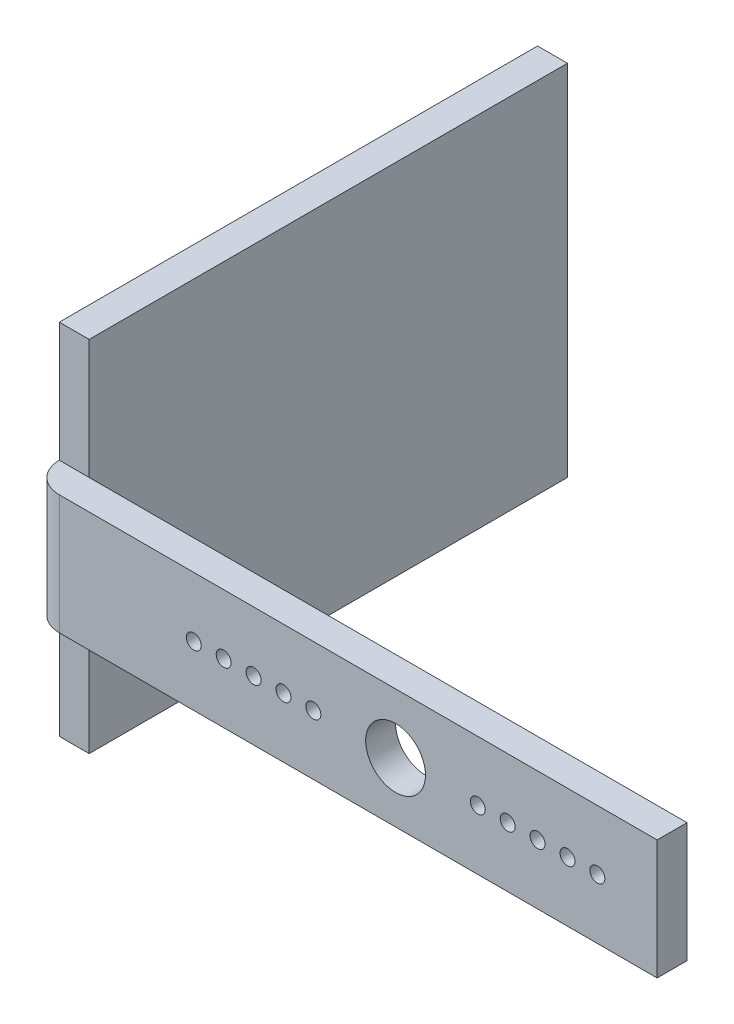
ISO-10303-21;
HEADER;
FILE_DESCRIPTION(('STEP AP214'),'2;1');
FILE_NAME('part.step','',(''),(''),'','','');
FILE_SCHEMA(('AUTOMOTIVE_DESIGN { 1 0 10303 214 1 1 1 1 }'));
ENDSEC;
DATA;
#1=APPLICATION_CONTEXT('core data for automotive mechanical design processes');
#2=APPLICATION_PROTOCOL_DEFINITION('international standard','automotive_design',2000,#1);
#3=PRODUCT_CONTEXT('',#1,'mechanical');
#4=PRODUCT('Part','Part','',(#3));
#5=PRODUCT_RELATED_PRODUCT_CATEGORY('part','',(#4));
#6=PRODUCT_DEFINITION_FORMATION('','',#4);
#7=PRODUCT_DEFINITION_CONTEXT('part definition',#1,'design');
#8=PRODUCT_DEFINITION('design','',#6,#7);
#9=PRODUCT_DEFINITION_SHAPE('','',#8);
#10=(LENGTH_UNIT() NAMED_UNIT(*) SI_UNIT(.MILLI.,.METRE.));
#11=(NAMED_UNIT(*) PLANE_ANGLE_UNIT() SI_UNIT($,.RADIAN.));
#12=(NAMED_UNIT(*) SI_UNIT($,.STERADIAN.) SOLID_ANGLE_UNIT());
#13=UNCERTAINTY_MEASURE_WITH_UNIT(LENGTH_MEASURE(1.E-05),#10,'distance_accuracy_value','');
#14=(GEOMETRIC_REPRESENTATION_CONTEXT(3) GLOBAL_UNCERTAINTY_ASSIGNED_CONTEXT((#13)) GLOBAL_UNIT_ASSIGNED_CONTEXT((#10,
#11,#12)) REPRESENTATION_CONTEXT('',''));
#15=CARTESIAN_POINT('',(0.,0.,0.));
#16=DIRECTION('',(0.,0.,1.));
#17=DIRECTION('',(1.,0.,0.));
#18=AXIS2_PLACEMENT_3D('',#15,#16,#17);
#19=CARTESIAN_POINT('',(-34.925,19.05,0.));
#20=DIRECTION('',(0.,0.,-1.));
#21=DIRECTION('',(0.,1.,0.));
#22=AXIS2_PLACEMENT_3D('',#19,#20,#21);
#23=PLANE('',#22);
#24=DIRECTION('',(-1.,0.,0.));
#25=VECTOR('',#24,1.);
#26=CARTESIAN_POINT('',(-34.925,6.35,0.));
#27=LINE('',#26,#25);
#28=CARTESIAN_POINT('',(-31.75,6.35,0.));
#29=VERTEX_POINT('',#28);
#30=CARTESIAN_POINT('',(-34.925,6.35,0.));
#31=VERTEX_POINT('',#30);
#32=EDGE_CURVE('E143',#29,#31,#27,.T.);
#33=ORIENTED_EDGE('',*,*,#32,.F.);
#34=DIRECTION('',(0.,1.,0.));
#35=VECTOR('',#34,1.);
#36=CARTESIAN_POINT('',(-31.75,19.05,0.));
#37=LINE('',#36,#35);
#38=CARTESIAN_POINT('',(-31.75,19.05,0.));
#39=VERTEX_POINT('',#38);
#40=EDGE_CURVE('E324',#29,#39,#37,.T.);
#41=ORIENTED_EDGE('',*,*,#40,.T.);
#42=DIRECTION('',(1.,0.,0.));
#43=VECTOR('',#42,1.);
#44=CARTESIAN_POINT('',(-34.925,19.05,0.));
#45=LINE('',#44,#43);
#46=CARTESIAN_POINT('',(-34.925,19.05,0.));
#47=VERTEX_POINT('',#46);
#48=EDGE_CURVE('E340',#47,#39,#45,.T.);
#49=ORIENTED_EDGE('',*,*,#48,.F.);
#50=DIRECTION('',(0.,1.,0.));
#51=VECTOR('',#50,1.);
#52=CARTESIAN_POINT('',(-34.925,19.05,0.));
#53=LINE('',#52,#51);
#54=EDGE_CURVE('E158',#31,#47,#53,.T.);
#55=ORIENTED_EDGE('',*,*,#54,.F.);
#56=EDGE_LOOP('',(#33,#41,#49,#55));
#57=FACE_BOUND('',#56,.T.);
#58=ADVANCED_FACE('F33',(#57),#23,.F.);
#59=CARTESIAN_POINT('',(-34.925,19.05,-50.8));
#60=DIRECTION('',(0.,0.,1.));
#61=DIRECTION('',(0.,-1.,0.));
#62=AXIS2_PLACEMENT_3D('',#59,#60,#61);
#63=PLANE('',#62);
#64=DIRECTION('',(0.,-1.,0.));
#65=VECTOR('',#64,1.);
#66=CARTESIAN_POINT('',(-31.75,19.05,-50.8));
#67=LINE('',#66,#65);
#68=CARTESIAN_POINT('',(-31.75,19.05,-50.8));
#69=VERTEX_POINT('',#68);
#70=CARTESIAN_POINT('',(-31.75,-19.05,-50.8));
#71=VERTEX_POINT('',#70);
#72=EDGE_CURVE('E167',#69,#71,#67,.T.);
#73=ORIENTED_EDGE('',*,*,#72,.T.);
#74=DIRECTION('',(1.,0.,0.));
#75=VECTOR('',#74,1.);
#76=CARTESIAN_POINT('',(-34.925,-19.05,-50.8));
#77=LINE('',#76,#75);
#78=CARTESIAN_POINT('',(-34.925,-19.05,-50.8));
#79=VERTEX_POINT('',#78);
#80=EDGE_CURVE('E276',#79,#71,#77,.T.);
#81=ORIENTED_EDGE('',*,*,#80,.F.);
#82=DIRECTION('',(0.,-1.,0.));
#83=VECTOR('',#82,1.);
#84=CARTESIAN_POINT('',(-34.925,19.05,-50.8));
#85=LINE('',#84,#83);
#86=CARTESIAN_POINT('',(-34.925,19.05,-50.8));
#87=VERTEX_POINT('',#86);
#88=EDGE_CURVE('E326',#87,#79,#85,.T.);
#89=ORIENTED_EDGE('',*,*,#88,.F.);
#90=DIRECTION('',(1.,0.,0.));
#91=VECTOR('',#90,1.);
#92=CARTESIAN_POINT('',(-34.925,19.05,-50.8));
#93=LINE('',#92,#91);
#94=EDGE_CURVE('E338',#87,#69,#93,.T.);
#95=ORIENTED_EDGE('',*,*,#94,.T.);
#96=EDGE_LOOP('',(#73,#81,#89,#95));
#97=FACE_BOUND('',#96,.T.);
#98=ADVANCED_FACE('F295',(#97),#63,.F.);
#99=CARTESIAN_POINT('',(-34.925,-19.05,-50.8));
#100=DIRECTION('',(0.,1.,0.));
#101=DIRECTION('',(0.,0.,1.));
#102=AXIS2_PLACEMENT_3D('',#99,#100,#101);
#103=PLANE('',#102);
#104=DIRECTION('',(0.,0.,1.));
#105=VECTOR('',#104,1.);
#106=CARTESIAN_POINT('',(-31.75,-19.05,-50.8));
#107=LINE('',#106,#105);
#108=CARTESIAN_POINT('',(-31.75,-19.05,0.));
#109=VERTEX_POINT('',#108);
#110=EDGE_CURVE('E328',#71,#109,#107,.T.);
#111=ORIENTED_EDGE('',*,*,#110,.T.);
#112=DIRECTION('',(1.,0.,0.));
#113=VECTOR('',#112,1.);
#114=CARTESIAN_POINT('',(-34.925,-19.05,0.));
#115=LINE('',#114,#113);
#116=CARTESIAN_POINT('',(-34.925,-19.05,0.));
#117=VERTEX_POINT('',#116);
#118=EDGE_CURVE('E322',#117,#109,#115,.T.);
#119=ORIENTED_EDGE('',*,*,#118,.F.);
#120=DIRECTION('',(0.,0.,1.));
#121=VECTOR('',#120,1.);
#122=CARTESIAN_POINT('',(-34.925,-19.05,-50.8));
#123=LINE('',#122,#121);
#124=EDGE_CURVE('E87',#79,#117,#123,.T.);
#125=ORIENTED_EDGE('',*,*,#124,.F.);
#126=ORIENTED_EDGE('',*,*,#80,.T.);
#127=EDGE_LOOP('',(#111,#119,#125,#126));
#128=FACE_BOUND('',#127,.T.);
#129=ADVANCED_FACE('F302',(#128),#103,.F.);
#130=CARTESIAN_POINT('',(-31.75,-6.35,0.));
#131=VERTEX_POINT('',#130);
#132=EDGE_CURVE('E319',#109,#131,#37,.T.);
#133=ORIENTED_EDGE('',*,*,#132,.T.);
#134=DIRECTION('',(-1.,0.,0.));
#135=VECTOR('',#134,1.);
#136=CARTESIAN_POINT('',(-34.925,-6.35,0.));
#137=LINE('',#136,#135);
#138=CARTESIAN_POINT('',(-34.925,-6.34999999999998,0.));
#139=VERTEX_POINT('',#138);
#140=EDGE_CURVE('E153',#131,#139,#137,.T.);
#141=ORIENTED_EDGE('',*,*,#140,.T.);
#142=EDGE_CURVE('E346',#117,#139,#53,.T.);
#143=ORIENTED_EDGE('',*,*,#142,.F.);
#144=ORIENTED_EDGE('',*,*,#118,.T.);
#145=EDGE_LOOP('',(#133,#141,#143,#144));
#146=FACE_BOUND('',#145,.T.);
#147=ADVANCED_FACE('F298',(#146),#23,.F.);
#148=CARTESIAN_POINT('',(-34.925,19.05,-50.8));
#149=DIRECTION('',(0.,-1.,0.));
#150=DIRECTION('',(0.,0.,-1.));
#151=AXIS2_PLACEMENT_3D('',#148,#149,#150);
#152=PLANE('',#151);
#153=DIRECTION('',(0.,0.,-1.));
#154=VECTOR('',#153,1.);
#155=CARTESIAN_POINT('',(-31.75,19.05,-50.8));
#156=LINE('',#155,#154);
#157=EDGE_CURVE('E79',#39,#69,#156,.T.);
#158=ORIENTED_EDGE('',*,*,#157,.T.);
#159=ORIENTED_EDGE('',*,*,#94,.F.);
#160=DIRECTION('',(0.,0.,-1.));
#161=VECTOR('',#160,1.);
#162=CARTESIAN_POINT('',(-34.925,19.05,-50.8));
#163=LINE('',#162,#161);
#164=EDGE_CURVE('E58',#47,#87,#163,.T.);
#165=ORIENTED_EDGE('',*,*,#164,.F.);
#166=ORIENTED_EDGE('',*,*,#48,.T.);
#167=EDGE_LOOP('',(#158,#159,#165,#166));
#168=FACE_BOUND('',#167,.T.);
#169=ADVANCED_FACE('F309',(#168),#152,.F.);
#170=CARTESIAN_POINT('',(-34.925,-19.05,-50.8));
#171=DIRECTION('',(-1.,0.,0.));
#172=DIRECTION('',(0.,0.,1.));
#173=AXIS2_PLACEMENT_3D('',#170,#171,#172);
#174=PLANE('',#173);
#175=ORIENTED_EDGE('',*,*,#88,.T.);
#176=ORIENTED_EDGE('',*,*,#124,.T.);
#177=ORIENTED_EDGE('',*,*,#142,.T.);
#178=DIRECTION('',(0.,1.,0.));
#179=VECTOR('',#178,1.);
#180=CARTESIAN_POINT('',(-34.925,-6.35,0.));
#181=LINE('',#180,#179);
#182=EDGE_CURVE('E164',#139,#31,#181,.T.);
#183=ORIENTED_EDGE('',*,*,#182,.T.);
#184=ORIENTED_EDGE('',*,*,#54,.T.);
#185=ORIENTED_EDGE('',*,*,#164,.T.);
#186=EDGE_LOOP('',(#175,#176,#177,#183,#184,#185));
#187=FACE_BOUND('',#186,.T.);
#188=ADVANCED_FACE('F315',(#187),#174,.T.);
#189=CARTESIAN_POINT('',(-31.75,-19.05,-50.8));
#190=DIRECTION('',(-1.,0.,0.));
#191=DIRECTION('',(0.,0.,1.));
#192=AXIS2_PLACEMENT_3D('',#189,#190,#191);
#193=PLANE('',#192);
#194=ORIENTED_EDGE('',*,*,#40,.F.);
#195=DIRECTION('',(0.,-1.,0.));
#196=VECTOR('',#195,1.);
#197=CARTESIAN_POINT('',(-31.75,-6.35,0.));
#198=LINE('',#197,#196);
#199=EDGE_CURVE('E174',#29,#131,#198,.T.);
#200=ORIENTED_EDGE('',*,*,#199,.T.);
#201=ORIENTED_EDGE('',*,*,#132,.F.);
#202=ORIENTED_EDGE('',*,*,#110,.F.);
#203=ORIENTED_EDGE('',*,*,#72,.F.);
#204=ORIENTED_EDGE('',*,*,#157,.F.);
#205=EDGE_LOOP('',(#194,#200,#201,#202,#203,#204));
#206=FACE_BOUND('',#205,.T.);
#207=ADVANCED_FACE('F358',(#206),#193,.F.);
#208=CARTESIAN_POINT('',(-31.75,-6.35,0.));
#209=DIRECTION('',(0.,1.,0.));
#210=DIRECTION('',(0.,0.,1.));
#211=AXIS2_PLACEMENT_3D('',#208,#209,#210);
#212=CYLINDRICAL_SURFACE('',#211,3.175);
#213=CARTESIAN_POINT('',(-31.75,6.35,0.));
#214=DIRECTION('',(0.,1.,0.));
#215=DIRECTION('',(0.,0.,-1.));
#216=AXIS2_PLACEMENT_3D('',#213,#214,#215);
#217=CIRCLE('',#216,3.175);
#218=CARTESIAN_POINT('',(-31.75,6.35,3.175));
#219=VERTEX_POINT('',#218);
#220=EDGE_CURVE('E124',#31,#219,#217,.T.);
#221=ORIENTED_EDGE('',*,*,#220,.F.);
#222=ORIENTED_EDGE('',*,*,#182,.F.);
#223=CARTESIAN_POINT('',(-31.75,-6.35,0.));
#224=DIRECTION('',(0.,1.,0.));
#225=DIRECTION('',(0.,0.,-1.));
#226=AXIS2_PLACEMENT_3D('',#223,#224,#225);
#227=CIRCLE('',#226,3.175);
#228=CARTESIAN_POINT('',(-31.75,-6.35,3.175));
#229=VERTEX_POINT('',#228);
#230=EDGE_CURVE('E49',#139,#229,#227,.T.);
#231=ORIENTED_EDGE('',*,*,#230,.T.);
#232=DIRECTION('',(0.,1.,0.));
#233=VECTOR('',#232,1.);
#234=CARTESIAN_POINT('',(-31.75,-6.35,3.175));
#235=LINE('',#234,#233);
#236=EDGE_CURVE('E157',#229,#219,#235,.T.);
#237=ORIENTED_EDGE('',*,*,#236,.T.);
#238=EDGE_LOOP('',(#221,#222,#231,#237));
#239=FACE_BOUND('',#238,.T.);
#240=ADVANCED_FACE('F354',(#239),#212,.T.);
#241=CARTESIAN_POINT('',(-31.75,-6.35,0.));
#242=DIRECTION('',(0.,-1.,0.));
#243=DIRECTION('',(0.,0.,-1.));
#244=AXIS2_PLACEMENT_3D('',#241,#242,#243);
#245=PLANE('',#244);
#246=ORIENTED_EDGE('',*,*,#230,.F.);
#247=ORIENTED_EDGE('',*,*,#140,.F.);
#248=DIRECTION('',(1.,0.,0.));
#249=VECTOR('',#248,1.);
#250=CARTESIAN_POINT('',(-31.75,-6.35,0.));
#251=LINE('',#250,#249);
#252=CARTESIAN_POINT('',(31.75,-6.35,0.));
#253=VERTEX_POINT('',#252);
#254=EDGE_CURVE('E136',#131,#253,#251,.T.);
#255=ORIENTED_EDGE('',*,*,#254,.T.);
#256=DIRECTION('',(0.,0.,-1.));
#257=VECTOR('',#256,1.);
#258=CARTESIAN_POINT('',(31.75,-6.35,3.175));
#259=LINE('',#258,#257);
#260=CARTESIAN_POINT('',(31.75,-6.35,3.175));
#261=VERTEX_POINT('',#260);
#262=EDGE_CURVE('E141',#261,#253,#259,.T.);
#263=ORIENTED_EDGE('',*,*,#262,.F.);
#264=DIRECTION('',(1.,0.,0.));
#265=VECTOR('',#264,1.);
#266=CARTESIAN_POINT('',(-31.75,-6.35,3.175));
#267=LINE('',#266,#265);
#268=EDGE_CURVE('E127',#229,#261,#267,.T.);
#269=ORIENTED_EDGE('',*,*,#268,.F.);
#270=EDGE_LOOP('',(#246,#247,#255,#263,#269));
#271=FACE_BOUND('',#270,.T.);
#272=ADVANCED_FACE('F355',(#271),#245,.T.);
#273=CARTESIAN_POINT('',(-31.75,6.35,0.));
#274=DIRECTION('',(0.,-1.,0.));
#275=DIRECTION('',(0.,0.,-1.));
#276=AXIS2_PLACEMENT_3D('',#273,#274,#275);
#277=PLANE('',#276);
#278=ORIENTED_EDGE('',*,*,#220,.T.);
#279=DIRECTION('',(-1.,0.,0.));
#280=VECTOR('',#279,1.);
#281=CARTESIAN_POINT('',(-31.75,6.35,3.175));
#282=LINE('',#281,#280);
#283=CARTESIAN_POINT('',(31.75,6.35,3.175));
#284=VERTEX_POINT('',#283);
#285=EDGE_CURVE('E117',#284,#219,#282,.T.);
#286=ORIENTED_EDGE('',*,*,#285,.F.);
#287=DIRECTION('',(0.,0.,-1.));
#288=VECTOR('',#287,1.);
#289=CARTESIAN_POINT('',(31.75,6.35,3.175));
#290=LINE('',#289,#288);
#291=CARTESIAN_POINT('',(31.75,6.35,0.));
#292=VERTEX_POINT('',#291);
#293=EDGE_CURVE('E121',#284,#292,#290,.T.);
#294=ORIENTED_EDGE('',*,*,#293,.T.);
#295=DIRECTION('',(-1.,0.,0.));
#296=VECTOR('',#295,1.);
#297=CARTESIAN_POINT('',(-31.75,6.35,0.));
#298=LINE('',#297,#296);
#299=EDGE_CURVE('E179',#292,#29,#298,.T.);
#300=ORIENTED_EDGE('',*,*,#299,.T.);
#301=ORIENTED_EDGE('',*,*,#32,.T.);
#302=EDGE_LOOP('',(#278,#286,#294,#300,#301));
#303=FACE_BOUND('',#302,.T.);
#304=ADVANCED_FACE('F119',(#303),#277,.F.);
#305=CARTESIAN_POINT('',(31.75,-6.35,3.175));
#306=DIRECTION('',(-1.,0.,0.));
#307=DIRECTION('',(0.,0.,1.));
#308=AXIS2_PLACEMENT_3D('',#305,#306,#307);
#309=PLANE('',#308);
#310=DIRECTION('',(0.,1.,0.));
#311=VECTOR('',#310,1.);
#312=CARTESIAN_POINT('',(31.75,-6.35,0.));
#313=LINE('',#312,#311);
#314=EDGE_CURVE('E140',#253,#292,#313,.T.);
#315=ORIENTED_EDGE('',*,*,#314,.T.);
#316=ORIENTED_EDGE('',*,*,#293,.F.);
#317=DIRECTION('',(0.,1.,0.));
#318=VECTOR('',#317,1.);
#319=CARTESIAN_POINT('',(31.75,-6.35,3.175));
#320=LINE('',#319,#318);
#321=EDGE_CURVE('E128',#261,#284,#320,.T.);
#322=ORIENTED_EDGE('',*,*,#321,.F.);
#323=ORIENTED_EDGE('',*,*,#262,.T.);
#324=EDGE_LOOP('',(#315,#316,#322,#323));
#325=FACE_BOUND('',#324,.T.);
#326=ADVANCED_FACE('F138',(#325),#309,.F.);
#327=CARTESIAN_POINT('',(31.75,6.35,3.175));
#328=DIRECTION('',(0.,0.,-1.));
#329=DIRECTION('',(-1.,0.,0.));
#330=AXIS2_PLACEMENT_3D('',#327,#328,#329);
#331=PLANE('',#330);
#332=CARTESIAN_POINT('',(3.96874999999999,0.,3.175));
#333=DIRECTION('',(0.,0.,1.));
#334=DIRECTION('',(1.,0.,0.));
#335=AXIS2_PLACEMENT_3D('',#332,#333,#334);
#336=CIRCLE('',#335,3.175);
#337=CARTESIAN_POINT('',(7.14374999999999,0.,3.175));
#338=VERTEX_POINT('',#337);
#339=EDGE_CURVE('E205',#338,#338,#336,.T.);
#340=ORIENTED_EDGE('',*,*,#339,.F.);
#341=EDGE_LOOP('',(#340));
#342=FACE_BOUND('',#341,.T.);
#343=CARTESIAN_POINT('',(-7.93750000000001,0.,3.175));
#344=DIRECTION('',(0.,0.,1.));
#345=DIRECTION('',(1.,0.,0.));
#346=AXIS2_PLACEMENT_3D('',#343,#344,#345);
#347=CIRCLE('',#346,0.79375);
#348=CARTESIAN_POINT('',(-7.14375000000001,0.,3.175));
#349=VERTEX_POINT('',#348);
#350=EDGE_CURVE('E199',#349,#349,#347,.T.);
#351=ORIENTED_EDGE('',*,*,#350,.F.);
#352=EDGE_LOOP('',(#351));
#353=FACE_BOUND('',#352,.T.);
#354=CARTESIAN_POINT('',(-4.76250000000001,0.,3.175));
#355=DIRECTION('',(0.,0.,1.));
#356=DIRECTION('',(1.,0.,0.));
#357=AXIS2_PLACEMENT_3D('',#354,#355,#356);
#358=CIRCLE('',#357,0.79375);
#359=CARTESIAN_POINT('',(-3.96875000000001,0.,3.175));
#360=VERTEX_POINT('',#359);
#361=EDGE_CURVE('E196',#360,#360,#358,.T.);
#362=ORIENTED_EDGE('',*,*,#361,.F.);
#363=EDGE_LOOP('',(#362));
#364=FACE_BOUND('',#363,.T.);
#365=CARTESIAN_POINT('',(22.225,0.,3.175));
#366=DIRECTION('',(0.,0.,1.));
#367=DIRECTION('',(1.,0.,0.));
#368=AXIS2_PLACEMENT_3D('',#365,#366,#367);
#369=CIRCLE('',#368,0.793749999999999);
#370=CARTESIAN_POINT('',(23.01875,0.,3.175));
#371=VERTEX_POINT('',#370);
#372=EDGE_CURVE('E189',#371,#371,#369,.T.);
#373=ORIENTED_EDGE('',*,*,#372,.F.);
#374=EDGE_LOOP('',(#373));
#375=FACE_BOUND('',#374,.T.);
#376=CARTESIAN_POINT('',(25.4,0.,3.175));
#377=DIRECTION('',(0.,0.,1.));
#378=DIRECTION('',(1.,0.,0.));
#379=AXIS2_PLACEMENT_3D('',#376,#377,#378);
#380=CIRCLE('',#379,0.793749999999999);
#381=CARTESIAN_POINT('',(26.19375,0.,3.175));
#382=VERTEX_POINT('',#381);
#383=EDGE_CURVE('E186',#382,#382,#380,.T.);
#384=ORIENTED_EDGE('',*,*,#383,.F.);
#385=EDGE_LOOP('',(#384));
#386=FACE_BOUND('',#385,.T.);
#387=ORIENTED_EDGE('',*,*,#321,.T.);
#388=ORIENTED_EDGE('',*,*,#285,.T.);
#389=ORIENTED_EDGE('',*,*,#236,.F.);
#390=ORIENTED_EDGE('',*,*,#268,.T.);
#391=EDGE_LOOP('',(#387,#388,#389,#390));
#392=FACE_BOUND('',#391,.T.);
#393=CARTESIAN_POINT('',(19.05,0.,3.175));
#394=DIRECTION('',(0.,0.,1.));
#395=DIRECTION('',(1.,0.,0.));
#396=AXIS2_PLACEMENT_3D('',#393,#394,#395);
#397=CIRCLE('',#396,0.793749999999999);
#398=CARTESIAN_POINT('',(19.84375,0.,3.175));
#399=VERTEX_POINT('',#398);
#400=EDGE_CURVE('E272',#399,#399,#397,.T.);
#401=ORIENTED_EDGE('',*,*,#400,.F.);
#402=EDGE_LOOP('',(#401));
#403=FACE_BOUND('',#402,.T.);
#404=CARTESIAN_POINT('',(15.875,0.,3.175));
#405=DIRECTION('',(0.,0.,1.));
#406=DIRECTION('',(1.,0.,0.));
#407=AXIS2_PLACEMENT_3D('',#404,#405,#406);
#408=CIRCLE('',#407,0.793749999999999);
#409=CARTESIAN_POINT('',(16.66875,0.,3.175));
#410=VERTEX_POINT('',#409);
#411=EDGE_CURVE('E268',#410,#410,#408,.T.);
#412=ORIENTED_EDGE('',*,*,#411,.F.);
#413=EDGE_LOOP('',(#412));
#414=FACE_BOUND('',#413,.T.);
#415=CARTESIAN_POINT('',(12.7,0.,3.175));
#416=DIRECTION('',(0.,0.,1.));
#417=DIRECTION('',(1.,0.,0.));
#418=AXIS2_PLACEMENT_3D('',#415,#416,#417);
#419=CIRCLE('',#418,0.793749999999999);
#420=CARTESIAN_POINT('',(13.49375,0.,3.175));
#421=VERTEX_POINT('',#420);
#422=EDGE_CURVE('E263',#421,#421,#419,.T.);
#423=ORIENTED_EDGE('',*,*,#422,.F.);
#424=EDGE_LOOP('',(#423));
#425=FACE_BOUND('',#424,.T.);
#426=CARTESIAN_POINT('',(-11.1125,0.,3.175));
#427=DIRECTION('',(0.,0.,1.));
#428=DIRECTION('',(1.,0.,0.));
#429=AXIS2_PLACEMENT_3D('',#426,#427,#428);
#430=CIRCLE('',#429,0.79375);
#431=CARTESIAN_POINT('',(-10.31875,0.,3.175));
#432=VERTEX_POINT('',#431);
#433=EDGE_CURVE('E259',#432,#432,#430,.T.);
#434=ORIENTED_EDGE('',*,*,#433,.F.);
#435=EDGE_LOOP('',(#434));
#436=FACE_BOUND('',#435,.T.);
#437=CARTESIAN_POINT('',(-14.2875,0.,3.175));
#438=DIRECTION('',(0.,0.,1.));
#439=DIRECTION('',(1.,0.,0.));
#440=AXIS2_PLACEMENT_3D('',#437,#438,#439);
#441=CIRCLE('',#440,0.79375);
#442=CARTESIAN_POINT('',(-13.49375,0.,3.175));
#443=VERTEX_POINT('',#442);
#444=EDGE_CURVE('E253',#443,#443,#441,.T.);
#445=ORIENTED_EDGE('',*,*,#444,.F.);
#446=EDGE_LOOP('',(#445));
#447=FACE_BOUND('',#446,.T.);
#448=CARTESIAN_POINT('',(-17.4625,0.,3.175));
#449=DIRECTION('',(0.,0.,1.));
#450=DIRECTION('',(1.,0.,0.));
#451=AXIS2_PLACEMENT_3D('',#448,#449,#450);
#452=CIRCLE('',#451,0.79375);
#453=CARTESIAN_POINT('',(-16.66875,0.,3.175));
#454=VERTEX_POINT('',#453);
#455=EDGE_CURVE('E11',#454,#454,#452,.T.);
#456=ORIENTED_EDGE('',*,*,#455,.F.);
#457=EDGE_LOOP('',(#456));
#458=FACE_BOUND('',#457,.T.);
#459=ADVANCED_FACE('F131',(#342,#353,#364,#375,#386,#392,#403,#414,#425,#436,#447,#458),#331,.F.);
#460=CARTESIAN_POINT('',(31.75,6.35,0.));
#461=DIRECTION('',(0.,0.,-1.));
#462=DIRECTION('',(-1.,0.,0.));
#463=AXIS2_PLACEMENT_3D('',#460,#461,#462);
#464=PLANE('',#463);
#465=CARTESIAN_POINT('',(3.96874999999999,0.,0.));
#466=DIRECTION('',(0.,0.,-1.));
#467=DIRECTION('',(-1.,0.,0.));
#468=AXIS2_PLACEMENT_3D('',#465,#466,#467);
#469=CIRCLE('',#468,3.175);
#470=CARTESIAN_POINT('',(0.793749999999985,0.,0.));
#471=VERTEX_POINT('',#470);
#472=EDGE_CURVE('E37',#471,#471,#469,.T.);
#473=ORIENTED_EDGE('',*,*,#472,.F.);
#474=EDGE_LOOP('',(#473));
#475=FACE_BOUND('',#474,.T.);
#476=CARTESIAN_POINT('',(-7.93750000000001,0.,0.));
#477=DIRECTION('',(0.,0.,-1.));
#478=DIRECTION('',(-1.,0.,0.));
#479=AXIS2_PLACEMENT_3D('',#476,#477,#478);
#480=CIRCLE('',#479,0.79375);
#481=CARTESIAN_POINT('',(-8.73125000000002,0.,0.));
#482=VERTEX_POINT('',#481);
#483=EDGE_CURVE('E202',#482,#482,#480,.T.);
#484=ORIENTED_EDGE('',*,*,#483,.F.);
#485=EDGE_LOOP('',(#484));
#486=FACE_BOUND('',#485,.T.);
#487=CARTESIAN_POINT('',(-4.76250000000001,0.,0.));
#488=DIRECTION('',(0.,0.,-1.));
#489=DIRECTION('',(-1.,0.,0.));
#490=AXIS2_PLACEMENT_3D('',#487,#488,#489);
#491=CIRCLE('',#490,0.79375);
#492=CARTESIAN_POINT('',(-5.55625000000001,0.,0.));
#493=VERTEX_POINT('',#492);
#494=EDGE_CURVE('E195',#493,#493,#491,.T.);
#495=ORIENTED_EDGE('',*,*,#494,.F.);
#496=EDGE_LOOP('',(#495));
#497=FACE_BOUND('',#496,.T.);
#498=CARTESIAN_POINT('',(22.225,0.,0.));
#499=DIRECTION('',(0.,0.,-1.));
#500=DIRECTION('',(-1.,0.,0.));
#501=AXIS2_PLACEMENT_3D('',#498,#499,#500);
#502=CIRCLE('',#501,0.793749999999999);
#503=CARTESIAN_POINT('',(21.43125,0.,0.));
#504=VERTEX_POINT('',#503);
#505=EDGE_CURVE('E192',#504,#504,#502,.T.);
#506=ORIENTED_EDGE('',*,*,#505,.F.);
#507=EDGE_LOOP('',(#506));
#508=FACE_BOUND('',#507,.T.);
#509=CARTESIAN_POINT('',(25.4,0.,0.));
#510=DIRECTION('',(0.,0.,-1.));
#511=DIRECTION('',(-1.,0.,0.));
#512=AXIS2_PLACEMENT_3D('',#509,#510,#511);
#513=CIRCLE('',#512,0.793749999999999);
#514=CARTESIAN_POINT('',(24.60625,0.,0.));
#515=VERTEX_POINT('',#514);
#516=EDGE_CURVE('E184',#515,#515,#513,.T.);
#517=ORIENTED_EDGE('',*,*,#516,.F.);
#518=EDGE_LOOP('',(#517));
#519=FACE_BOUND('',#518,.T.);
#520=ORIENTED_EDGE('',*,*,#314,.F.);
#521=ORIENTED_EDGE('',*,*,#254,.F.);
#522=ORIENTED_EDGE('',*,*,#199,.F.);
#523=ORIENTED_EDGE('',*,*,#299,.F.);
#524=EDGE_LOOP('',(#520,#521,#522,#523));
#525=FACE_BOUND('',#524,.T.);
#526=CARTESIAN_POINT('',(19.05,0.,0.));
#527=DIRECTION('',(0.,0.,-1.));
#528=DIRECTION('',(-1.,0.,0.));
#529=AXIS2_PLACEMENT_3D('',#526,#527,#528);
#530=CIRCLE('',#529,0.793749999999999);
#531=CARTESIAN_POINT('',(18.25625,0.,0.));
#532=VERTEX_POINT('',#531);
#533=EDGE_CURVE('E233',#532,#532,#530,.T.);
#534=ORIENTED_EDGE('',*,*,#533,.F.);
#535=EDGE_LOOP('',(#534));
#536=FACE_BOUND('',#535,.T.);
#537=CARTESIAN_POINT('',(15.875,0.,0.));
#538=DIRECTION('',(0.,0.,-1.));
#539=DIRECTION('',(-1.,0.,0.));
#540=AXIS2_PLACEMENT_3D('',#537,#538,#539);
#541=CIRCLE('',#540,0.793749999999999);
#542=CARTESIAN_POINT('',(15.08125,0.,0.));
#543=VERTEX_POINT('',#542);
#544=EDGE_CURVE('E237',#543,#543,#541,.T.);
#545=ORIENTED_EDGE('',*,*,#544,.F.);
#546=EDGE_LOOP('',(#545));
#547=FACE_BOUND('',#546,.T.);
#548=CARTESIAN_POINT('',(12.7,0.,0.));
#549=DIRECTION('',(0.,0.,-1.));
#550=DIRECTION('',(-1.,0.,0.));
#551=AXIS2_PLACEMENT_3D('',#548,#549,#550);
#552=CIRCLE('',#551,0.793749999999999);
#553=CARTESIAN_POINT('',(11.90625,0.,0.));
#554=VERTEX_POINT('',#553);
#555=EDGE_CURVE('E241',#554,#554,#552,.T.);
#556=ORIENTED_EDGE('',*,*,#555,.F.);
#557=EDGE_LOOP('',(#556));
#558=FACE_BOUND('',#557,.T.);
#559=CARTESIAN_POINT('',(-11.1125,0.,0.));
#560=DIRECTION('',(0.,0.,-1.));
#561=DIRECTION('',(-1.,0.,0.));
#562=AXIS2_PLACEMENT_3D('',#559,#560,#561);
#563=CIRCLE('',#562,0.79375);
#564=CARTESIAN_POINT('',(-11.90625,0.,0.));
#565=VERTEX_POINT('',#564);
#566=EDGE_CURVE('E245',#565,#565,#563,.T.);
#567=ORIENTED_EDGE('',*,*,#566,.F.);
#568=EDGE_LOOP('',(#567));
#569=FACE_BOUND('',#568,.T.);
#570=CARTESIAN_POINT('',(-14.2875,0.,0.));
#571=DIRECTION('',(0.,0.,-1.));
#572=DIRECTION('',(-1.,0.,0.));
#573=AXIS2_PLACEMENT_3D('',#570,#571,#572);
#574=CIRCLE('',#573,0.79375);
#575=CARTESIAN_POINT('',(-15.08125,0.,0.));
#576=VERTEX_POINT('',#575);
#577=EDGE_CURVE('E249',#576,#576,#574,.T.);
#578=ORIENTED_EDGE('',*,*,#577,.F.);
#579=EDGE_LOOP('',(#578));
#580=FACE_BOUND('',#579,.T.);
#581=CARTESIAN_POINT('',(-17.4625,0.,0.));
#582=DIRECTION('',(0.,0.,-1.));
#583=DIRECTION('',(-1.,0.,0.));
#584=AXIS2_PLACEMENT_3D('',#581,#582,#583);
#585=CIRCLE('',#584,0.79375);
#586=CARTESIAN_POINT('',(-18.25625,0.,0.));
#587=VERTEX_POINT('',#586);
#588=EDGE_CURVE('E42',#587,#587,#585,.T.);
#589=ORIENTED_EDGE('',*,*,#588,.F.);
#590=EDGE_LOOP('',(#589));
#591=FACE_BOUND('',#590,.T.);
#592=ADVANCED_FACE('F214',(#475,#486,#497,#508,#519,#525,#536,#547,#558,#569,#580,#591),#464,.T.);
#593=CARTESIAN_POINT('',(25.4,0.,-3.175));
#594=DIRECTION('',(0.,0.,1.));
#595=DIRECTION('',(1.,0.,0.));
#596=AXIS2_PLACEMENT_3D('',#593,#594,#595);
#597=CYLINDRICAL_SURFACE('',#596,0.793749999999999);
#598=ORIENTED_EDGE('',*,*,#516,.T.);
#599=EDGE_LOOP('',(#598));
#600=FACE_BOUND('',#599,.T.);
#601=ORIENTED_EDGE('',*,*,#383,.T.);
#602=EDGE_LOOP('',(#601));
#603=FACE_BOUND('',#602,.T.);
#604=ADVANCED_FACE('F217',(#600,#603),#597,.F.);
#605=CARTESIAN_POINT('',(22.225,0.,-3.175));
#606=DIRECTION('',(0.,0.,1.));
#607=DIRECTION('',(1.,0.,0.));
#608=AXIS2_PLACEMENT_3D('',#605,#606,#607);
#609=CYLINDRICAL_SURFACE('',#608,0.793749999999999);
#610=ORIENTED_EDGE('',*,*,#505,.T.);
#611=EDGE_LOOP('',(#610));
#612=FACE_BOUND('',#611,.T.);
#613=ORIENTED_EDGE('',*,*,#372,.T.);
#614=EDGE_LOOP('',(#613));
#615=FACE_BOUND('',#614,.T.);
#616=ADVANCED_FACE('F281',(#612,#615),#609,.F.);
#617=CARTESIAN_POINT('',(19.05,0.,-3.175));
#618=DIRECTION('',(0.,0.,1.));
#619=DIRECTION('',(1.,0.,0.));
#620=AXIS2_PLACEMENT_3D('',#617,#618,#619);
#621=CYLINDRICAL_SURFACE('',#620,0.793749999999999);
#622=ORIENTED_EDGE('',*,*,#533,.T.);
#623=EDGE_LOOP('',(#622));
#624=FACE_BOUND('',#623,.T.);
#625=ORIENTED_EDGE('',*,*,#400,.T.);
#626=EDGE_LOOP('',(#625));
#627=FACE_BOUND('',#626,.T.);
#628=ADVANCED_FACE('F405',(#624,#627),#621,.F.);
#629=CARTESIAN_POINT('',(15.875,0.,-3.175));
#630=DIRECTION('',(0.,0.,1.));
#631=DIRECTION('',(1.,0.,0.));
#632=AXIS2_PLACEMENT_3D('',#629,#630,#631);
#633=CYLINDRICAL_SURFACE('',#632,0.793749999999999);
#634=ORIENTED_EDGE('',*,*,#544,.T.);
#635=EDGE_LOOP('',(#634));
#636=FACE_BOUND('',#635,.T.);
#637=ORIENTED_EDGE('',*,*,#411,.T.);
#638=EDGE_LOOP('',(#637));
#639=FACE_BOUND('',#638,.T.);
#640=ADVANCED_FACE('F413',(#636,#639),#633,.F.);
#641=CARTESIAN_POINT('',(12.7,0.,-3.175));
#642=DIRECTION('',(0.,0.,1.));
#643=DIRECTION('',(1.,0.,0.));
#644=AXIS2_PLACEMENT_3D('',#641,#642,#643);
#645=CYLINDRICAL_SURFACE('',#644,0.793749999999999);
#646=ORIENTED_EDGE('',*,*,#555,.T.);
#647=EDGE_LOOP('',(#646));
#648=FACE_BOUND('',#647,.T.);
#649=ORIENTED_EDGE('',*,*,#422,.T.);
#650=EDGE_LOOP('',(#649));
#651=FACE_BOUND('',#650,.T.);
#652=ADVANCED_FACE('F421',(#648,#651),#645,.F.);
#653=CARTESIAN_POINT('',(-4.76250000000001,0.,-3.175));
#654=DIRECTION('',(0.,0.,1.));
#655=DIRECTION('',(1.,0.,0.));
#656=AXIS2_PLACEMENT_3D('',#653,#654,#655);
#657=CYLINDRICAL_SURFACE('',#656,0.79375);
#658=ORIENTED_EDGE('',*,*,#494,.T.);
#659=EDGE_LOOP('',(#658));
#660=FACE_BOUND('',#659,.T.);
#661=ORIENTED_EDGE('',*,*,#361,.T.);
#662=EDGE_LOOP('',(#661));
#663=FACE_BOUND('',#662,.T.);
#664=ADVANCED_FACE('F429',(#660,#663),#657,.F.);
#665=CARTESIAN_POINT('',(-7.93750000000001,0.,-3.175));
#666=DIRECTION('',(0.,0.,1.));
#667=DIRECTION('',(1.,0.,0.));
#668=AXIS2_PLACEMENT_3D('',#665,#666,#667);
#669=CYLINDRICAL_SURFACE('',#668,0.79375);
#670=ORIENTED_EDGE('',*,*,#483,.T.);
#671=EDGE_LOOP('',(#670));
#672=FACE_BOUND('',#671,.T.);
#673=ORIENTED_EDGE('',*,*,#350,.T.);
#674=EDGE_LOOP('',(#673));
#675=FACE_BOUND('',#674,.T.);
#676=ADVANCED_FACE('F437',(#672,#675),#669,.F.);
#677=CARTESIAN_POINT('',(-11.1125,0.,-3.175));
#678=DIRECTION('',(0.,0.,1.));
#679=DIRECTION('',(1.,0.,0.));
#680=AXIS2_PLACEMENT_3D('',#677,#678,#679);
#681=CYLINDRICAL_SURFACE('',#680,0.79375);
#682=ORIENTED_EDGE('',*,*,#566,.T.);
#683=EDGE_LOOP('',(#682));
#684=FACE_BOUND('',#683,.T.);
#685=ORIENTED_EDGE('',*,*,#433,.T.);
#686=EDGE_LOOP('',(#685));
#687=FACE_BOUND('',#686,.T.);
#688=ADVANCED_FACE('F445',(#684,#687),#681,.F.);
#689=CARTESIAN_POINT('',(-14.2875,0.,-3.175));
#690=DIRECTION('',(0.,0.,1.));
#691=DIRECTION('',(1.,0.,0.));
#692=AXIS2_PLACEMENT_3D('',#689,#690,#691);
#693=CYLINDRICAL_SURFACE('',#692,0.79375);
#694=ORIENTED_EDGE('',*,*,#577,.T.);
#695=EDGE_LOOP('',(#694));
#696=FACE_BOUND('',#695,.T.);
#697=ORIENTED_EDGE('',*,*,#444,.T.);
#698=EDGE_LOOP('',(#697));
#699=FACE_BOUND('',#698,.T.);
#700=ADVANCED_FACE('F453',(#696,#699),#693,.F.);
#701=CARTESIAN_POINT('',(-17.4625,0.,-3.175));
#702=DIRECTION('',(0.,0.,1.));
#703=DIRECTION('',(1.,0.,0.));
#704=AXIS2_PLACEMENT_3D('',#701,#702,#703);
#705=CYLINDRICAL_SURFACE('',#704,0.79375);
#706=ORIENTED_EDGE('',*,*,#588,.T.);
#707=EDGE_LOOP('',(#706));
#708=FACE_BOUND('',#707,.T.);
#709=ORIENTED_EDGE('',*,*,#455,.T.);
#710=EDGE_LOOP('',(#709));
#711=FACE_BOUND('',#710,.T.);
#712=ADVANCED_FACE('F35',(#708,#711),#705,.F.);
#713=CARTESIAN_POINT('',(3.96874999999999,0.,-50.8));
#714=DIRECTION('',(0.,0.,1.));
#715=DIRECTION('',(1.,0.,0.));
#716=AXIS2_PLACEMENT_3D('',#713,#714,#715);
#717=CYLINDRICAL_SURFACE('',#716,3.175);
#718=ORIENTED_EDGE('',*,*,#472,.T.);
#719=EDGE_LOOP('',(#718));
#720=FACE_BOUND('',#719,.T.);
#721=ORIENTED_EDGE('',*,*,#339,.T.);
#722=EDGE_LOOP('',(#721));
#723=FACE_BOUND('',#722,.T.);
#724=ADVANCED_FACE('F212',(#720,#723),#717,.F.);
#725=CLOSED_SHELL('',(#58,#98,#129,#147,#169,#188,#207,#240,#272,#304,#326,#459,#592,#604,#616,
#628,#640,#652,#664,#676,#688,#700,#712,#724));
#726=MANIFOLD_SOLID_BREP('B2',#725);
#727=ADVANCED_BREP_SHAPE_REPRESENTATION('',(#18,#726),#14);
#728=SHAPE_DEFINITION_REPRESENTATION(#9,#727);
ENDSEC;
END-ISO-10303-21;
